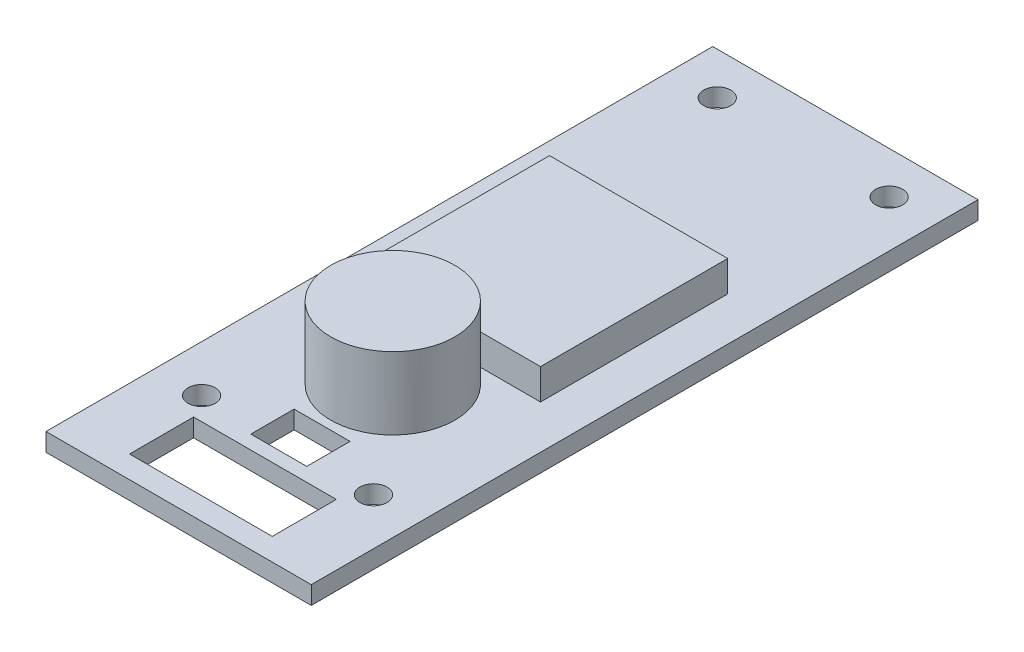
ISO-10303-21;
HEADER;
FILE_DESCRIPTION(('STEP AP214'),'2;1');
FILE_NAME('part.step','',(''),(''),'','','');
FILE_SCHEMA(('AUTOMOTIVE_DESIGN { 1 0 10303 214 1 1 1 1 }'));
ENDSEC;
DATA;
#1=APPLICATION_CONTEXT('core data for automotive mechanical design processes');
#2=APPLICATION_PROTOCOL_DEFINITION('international standard','automotive_design',2000,#1);
#3=PRODUCT_CONTEXT('',#1,'mechanical');
#4=PRODUCT('Part','Part','',(#3));
#5=PRODUCT_RELATED_PRODUCT_CATEGORY('part','',(#4));
#6=PRODUCT_DEFINITION_FORMATION('','',#4);
#7=PRODUCT_DEFINITION_CONTEXT('part definition',#1,'design');
#8=PRODUCT_DEFINITION('design','',#6,#7);
#9=PRODUCT_DEFINITION_SHAPE('','',#8);
#10=(LENGTH_UNIT() NAMED_UNIT(*) SI_UNIT(.MILLI.,.METRE.));
#11=(NAMED_UNIT(*) PLANE_ANGLE_UNIT() SI_UNIT($,.RADIAN.));
#12=(NAMED_UNIT(*) SI_UNIT($,.STERADIAN.) SOLID_ANGLE_UNIT());
#13=UNCERTAINTY_MEASURE_WITH_UNIT(LENGTH_MEASURE(1.E-05),#10,'distance_accuracy_value','');
#14=(GEOMETRIC_REPRESENTATION_CONTEXT(3) GLOBAL_UNCERTAINTY_ASSIGNED_CONTEXT((#13)) GLOBAL_UNIT_ASSIGNED_CONTEXT((#10,
#11,#12)) REPRESENTATION_CONTEXT('',''));
#15=CARTESIAN_POINT('',(0.,0.,0.));
#16=DIRECTION('',(0.,0.,1.));
#17=DIRECTION('',(1.,0.,0.));
#18=AXIS2_PLACEMENT_3D('',#15,#16,#17);
#19=CARTESIAN_POINT('',(0.,2.,36.95));
#20=DIRECTION('',(0.,0.,1.));
#21=DIRECTION('',(1.,0.,0.));
#22=AXIS2_PLACEMENT_3D('',#19,#20,#21);
#23=PLANE('',#22);
#24=DIRECTION('',(-1.,0.,0.));
#25=VECTOR('',#24,1.);
#26=CARTESIAN_POINT('',(0.,0.,36.95));
#27=LINE('',#26,#25);
#28=CARTESIAN_POINT('',(14.7,0.,36.95));
#29=VERTEX_POINT('',#28);
#30=CARTESIAN_POINT('',(-14.7,0.,36.95));
#31=VERTEX_POINT('',#30);
#32=EDGE_CURVE('E280',#29,#31,#27,.T.);
#33=ORIENTED_EDGE('',*,*,#32,.F.);
#34=DIRECTION('',(0.,-1.,0.));
#35=VECTOR('',#34,1.);
#36=CARTESIAN_POINT('',(14.7,2.,36.95));
#37=LINE('',#36,#35);
#38=CARTESIAN_POINT('',(14.7,2.,36.95));
#39=VERTEX_POINT('',#38);
#40=EDGE_CURVE('E12',#39,#29,#37,.T.);
#41=ORIENTED_EDGE('',*,*,#40,.F.);
#42=DIRECTION('',(-1.,0.,0.));
#43=VECTOR('',#42,1.);
#44=CARTESIAN_POINT('',(0.,2.,36.95));
#45=LINE('',#44,#43);
#46=CARTESIAN_POINT('',(-14.7,2.,36.95));
#47=VERTEX_POINT('',#46);
#48=EDGE_CURVE('E190',#39,#47,#45,.T.);
#49=ORIENTED_EDGE('',*,*,#48,.T.);
#50=DIRECTION('',(0.,-1.,0.));
#51=VECTOR('',#50,1.);
#52=CARTESIAN_POINT('',(-14.7,2.,36.95));
#53=LINE('',#52,#51);
#54=EDGE_CURVE('E76',#47,#31,#53,.T.);
#55=ORIENTED_EDGE('',*,*,#54,.T.);
#56=EDGE_LOOP('',(#33,#41,#49,#55));
#57=FACE_BOUND('',#56,.T.);
#58=ADVANCED_FACE('F49',(#57),#23,.T.);
#59=CARTESIAN_POINT('',(14.7,2.,0.));
#60=DIRECTION('',(-1.,0.,0.));
#61=DIRECTION('',(0.,0.,1.));
#62=AXIS2_PLACEMENT_3D('',#59,#60,#61);
#63=PLANE('',#62);
#64=DIRECTION('',(0.,0.,-1.));
#65=VECTOR('',#64,1.);
#66=CARTESIAN_POINT('',(14.7,0.,0.));
#67=LINE('',#66,#65);
#68=CARTESIAN_POINT('',(14.7,0.,-36.95));
#69=VERTEX_POINT('',#68);
#70=EDGE_CURVE('E196',#29,#69,#67,.T.);
#71=ORIENTED_EDGE('',*,*,#70,.T.);
#72=DIRECTION('',(0.,-1.,0.));
#73=VECTOR('',#72,1.);
#74=CARTESIAN_POINT('',(14.7,2.,-36.95));
#75=LINE('',#74,#73);
#76=CARTESIAN_POINT('',(14.7,2.,-36.95));
#77=VERTEX_POINT('',#76);
#78=EDGE_CURVE('E59',#77,#69,#75,.T.);
#79=ORIENTED_EDGE('',*,*,#78,.F.);
#80=DIRECTION('',(0.,0.,-1.));
#81=VECTOR('',#80,1.);
#82=CARTESIAN_POINT('',(14.7,2.,0.));
#83=LINE('',#82,#81);
#84=EDGE_CURVE('E185',#39,#77,#83,.T.);
#85=ORIENTED_EDGE('',*,*,#84,.F.);
#86=ORIENTED_EDGE('',*,*,#40,.T.);
#87=EDGE_LOOP('',(#71,#79,#85,#86));
#88=FACE_BOUND('',#87,.T.);
#89=ADVANCED_FACE('F194',(#88),#63,.F.);
#90=CARTESIAN_POINT('',(0.,2.,-36.95));
#91=DIRECTION('',(0.,0.,1.));
#92=DIRECTION('',(1.,0.,0.));
#93=AXIS2_PLACEMENT_3D('',#90,#91,#92);
#94=PLANE('',#93);
#95=DIRECTION('',(-1.,0.,0.));
#96=VECTOR('',#95,1.);
#97=CARTESIAN_POINT('',(0.,0.,-36.95));
#98=LINE('',#97,#96);
#99=CARTESIAN_POINT('',(-14.7,0.,-36.95));
#100=VERTEX_POINT('',#99);
#101=EDGE_CURVE('E285',#69,#100,#98,.T.);
#102=ORIENTED_EDGE('',*,*,#101,.T.);
#103=DIRECTION('',(0.,-1.,0.));
#104=VECTOR('',#103,1.);
#105=CARTESIAN_POINT('',(-14.7,2.,-36.95));
#106=LINE('',#105,#104);
#107=CARTESIAN_POINT('',(-14.7,2.,-36.95));
#108=VERTEX_POINT('',#107);
#109=EDGE_CURVE('E180',#108,#100,#106,.T.);
#110=ORIENTED_EDGE('',*,*,#109,.F.);
#111=DIRECTION('',(-1.,0.,0.));
#112=VECTOR('',#111,1.);
#113=CARTESIAN_POINT('',(0.,2.,-36.95));
#114=LINE('',#113,#112);
#115=EDGE_CURVE('E174',#77,#108,#114,.T.);
#116=ORIENTED_EDGE('',*,*,#115,.F.);
#117=ORIENTED_EDGE('',*,*,#78,.T.);
#118=EDGE_LOOP('',(#102,#110,#116,#117));
#119=FACE_BOUND('',#118,.T.);
#120=ADVANCED_FACE('F177',(#119),#94,.F.);
#121=CARTESIAN_POINT('',(-7.91000000000001,2.,0.));
#122=DIRECTION('',(1.,0.,0.));
#123=DIRECTION('',(0.,0.,-1.));
#124=AXIS2_PLACEMENT_3D('',#121,#122,#123);
#125=PLANE('',#124);
#126=DIRECTION('',(0.,0.,1.));
#127=VECTOR('',#126,1.);
#128=CARTESIAN_POINT('',(-7.91000000000001,0.,0.));
#129=LINE('',#128,#127);
#130=CARTESIAN_POINT('',(-7.91,0.,27.382));
#131=VERTEX_POINT('',#130);
#132=CARTESIAN_POINT('',(-7.91,0.,34.482));
#133=VERTEX_POINT('',#132);
#134=EDGE_CURVE('E264',#131,#133,#129,.T.);
#135=ORIENTED_EDGE('',*,*,#134,.F.);
#136=DIRECTION('',(0.,-1.,0.));
#137=VECTOR('',#136,1.);
#138=CARTESIAN_POINT('',(-7.91,2.,27.382));
#139=LINE('',#138,#137);
#140=CARTESIAN_POINT('',(-7.91,2.,27.382));
#141=VERTEX_POINT('',#140);
#142=EDGE_CURVE('E213',#141,#131,#139,.T.);
#143=ORIENTED_EDGE('',*,*,#142,.F.);
#144=DIRECTION('',(0.,0.,1.));
#145=VECTOR('',#144,1.);
#146=CARTESIAN_POINT('',(-7.91000000000001,2.,0.));
#147=LINE('',#146,#145);
#148=CARTESIAN_POINT('',(-7.91,2.,34.482));
#149=VERTEX_POINT('',#148);
#150=EDGE_CURVE('E327',#141,#149,#147,.T.);
#151=ORIENTED_EDGE('',*,*,#150,.T.);
#152=DIRECTION('',(0.,-1.,0.));
#153=VECTOR('',#152,1.);
#154=CARTESIAN_POINT('',(-7.91,2.,34.482));
#155=LINE('',#154,#153);
#156=EDGE_CURVE('E203',#149,#133,#155,.T.);
#157=ORIENTED_EDGE('',*,*,#156,.T.);
#158=EDGE_LOOP('',(#135,#143,#151,#157));
#159=FACE_BOUND('',#158,.T.);
#160=ADVANCED_FACE('F480',(#159),#125,.T.);
#161=CARTESIAN_POINT('',(0.,2.,27.382));
#162=DIRECTION('',(0.,0.,-1.));
#163=DIRECTION('',(-1.,0.,0.));
#164=AXIS2_PLACEMENT_3D('',#161,#162,#163);
#165=PLANE('',#164);
#166=DIRECTION('',(1.,0.,0.));
#167=VECTOR('',#166,1.);
#168=CARTESIAN_POINT('',(0.,0.,27.382));
#169=LINE('',#168,#167);
#170=CARTESIAN_POINT('',(7.91,0.,27.382));
#171=VERTEX_POINT('',#170);
#172=EDGE_CURVE('E268',#131,#171,#169,.T.);
#173=ORIENTED_EDGE('',*,*,#172,.T.);
#174=DIRECTION('',(0.,-1.,0.));
#175=VECTOR('',#174,1.);
#176=CARTESIAN_POINT('',(7.91,2.,27.382));
#177=LINE('',#176,#175);
#178=CARTESIAN_POINT('',(7.91,2.,27.382));
#179=VERTEX_POINT('',#178);
#180=EDGE_CURVE('E209',#179,#171,#177,.T.);
#181=ORIENTED_EDGE('',*,*,#180,.F.);
#182=DIRECTION('',(1.,0.,0.));
#183=VECTOR('',#182,1.);
#184=CARTESIAN_POINT('',(0.,2.,27.382));
#185=LINE('',#184,#183);
#186=EDGE_CURVE('E331',#141,#179,#185,.T.);
#187=ORIENTED_EDGE('',*,*,#186,.F.);
#188=ORIENTED_EDGE('',*,*,#142,.T.);
#189=EDGE_LOOP('',(#173,#181,#187,#188));
#190=FACE_BOUND('',#189,.T.);
#191=ADVANCED_FACE('F476',(#190),#165,.F.);
#192=CARTESIAN_POINT('',(7.90999999999999,2.,0.));
#193=DIRECTION('',(1.,0.,0.));
#194=DIRECTION('',(0.,0.,-1.));
#195=AXIS2_PLACEMENT_3D('',#192,#193,#194);
#196=PLANE('',#195);
#197=DIRECTION('',(0.,0.,1.));
#198=VECTOR('',#197,1.);
#199=CARTESIAN_POINT('',(7.90999999999999,0.,0.));
#200=LINE('',#199,#198);
#201=CARTESIAN_POINT('',(7.91,0.,34.482));
#202=VERTEX_POINT('',#201);
#203=EDGE_CURVE('E272',#171,#202,#200,.T.);
#204=ORIENTED_EDGE('',*,*,#203,.T.);
#205=DIRECTION('',(0.,-1.,0.));
#206=VECTOR('',#205,1.);
#207=CARTESIAN_POINT('',(7.91,2.,34.482));
#208=LINE('',#207,#206);
#209=CARTESIAN_POINT('',(7.91,2.,34.482));
#210=VERTEX_POINT('',#209);
#211=EDGE_CURVE('E206',#210,#202,#208,.T.);
#212=ORIENTED_EDGE('',*,*,#211,.F.);
#213=DIRECTION('',(0.,0.,1.));
#214=VECTOR('',#213,1.);
#215=CARTESIAN_POINT('',(7.90999999999999,2.,0.));
#216=LINE('',#215,#214);
#217=EDGE_CURVE('E335',#179,#210,#216,.T.);
#218=ORIENTED_EDGE('',*,*,#217,.F.);
#219=ORIENTED_EDGE('',*,*,#180,.T.);
#220=EDGE_LOOP('',(#204,#212,#218,#219));
#221=FACE_BOUND('',#220,.T.);
#222=ADVANCED_FACE('F473',(#221),#196,.F.);
#223=CARTESIAN_POINT('',(3.1,2.,0.));
#224=DIRECTION('',(-1.,0.,0.));
#225=DIRECTION('',(0.,0.,1.));
#226=AXIS2_PLACEMENT_3D('',#223,#224,#225);
#227=PLANE('',#226);
#228=DIRECTION('',(0.,0.,-1.));
#229=VECTOR('',#228,1.);
#230=CARTESIAN_POINT('',(3.1,0.,0.));
#231=LINE('',#230,#229);
#232=CARTESIAN_POINT('',(3.1,0.,25.849));
#233=VERTEX_POINT('',#232);
#234=CARTESIAN_POINT('',(3.1,0.,21.049));
#235=VERTEX_POINT('',#234);
#236=EDGE_CURVE('E245',#233,#235,#231,.T.);
#237=ORIENTED_EDGE('',*,*,#236,.F.);
#238=DIRECTION('',(0.,-1.,0.));
#239=VECTOR('',#238,1.);
#240=CARTESIAN_POINT('',(3.1,2.,25.849));
#241=LINE('',#240,#239);
#242=CARTESIAN_POINT('',(3.1,2.,25.849));
#243=VERTEX_POINT('',#242);
#244=EDGE_CURVE('E53',#243,#233,#241,.T.);
#245=ORIENTED_EDGE('',*,*,#244,.F.);
#246=DIRECTION('',(0.,0.,-1.));
#247=VECTOR('',#246,1.);
#248=CARTESIAN_POINT('',(3.1,2.,0.));
#249=LINE('',#248,#247);
#250=CARTESIAN_POINT('',(3.1,2.,21.049));
#251=VERTEX_POINT('',#250);
#252=EDGE_CURVE('E315',#243,#251,#249,.T.);
#253=ORIENTED_EDGE('',*,*,#252,.T.);
#254=DIRECTION('',(0.,-1.,0.));
#255=VECTOR('',#254,1.);
#256=CARTESIAN_POINT('',(3.1,2.,21.049));
#257=LINE('',#256,#255);
#258=EDGE_CURVE('E216',#251,#235,#257,.T.);
#259=ORIENTED_EDGE('',*,*,#258,.T.);
#260=EDGE_LOOP('',(#237,#245,#253,#259));
#261=FACE_BOUND('',#260,.T.);
#262=ADVANCED_FACE('F51',(#261),#227,.T.);
#263=CARTESIAN_POINT('',(0.,2.,25.849));
#264=DIRECTION('',(0.,0.,1.));
#265=DIRECTION('',(1.,0.,0.));
#266=AXIS2_PLACEMENT_3D('',#263,#264,#265);
#267=PLANE('',#266);
#268=DIRECTION('',(-1.,0.,0.));
#269=VECTOR('',#268,1.);
#270=CARTESIAN_POINT('',(0.,0.,25.849));
#271=LINE('',#270,#269);
#272=CARTESIAN_POINT('',(-3.1,0.,25.849));
#273=VERTEX_POINT('',#272);
#274=EDGE_CURVE('E233',#233,#273,#271,.T.);
#275=ORIENTED_EDGE('',*,*,#274,.T.);
#276=DIRECTION('',(0.,-1.,0.));
#277=VECTOR('',#276,1.);
#278=CARTESIAN_POINT('',(-3.1,2.,25.849));
#279=LINE('',#278,#277);
#280=CARTESIAN_POINT('',(-3.1,2.,25.849));
#281=VERTEX_POINT('',#280);
#282=EDGE_CURVE('E221',#281,#273,#279,.T.);
#283=ORIENTED_EDGE('',*,*,#282,.F.);
#284=DIRECTION('',(-1.,0.,0.));
#285=VECTOR('',#284,1.);
#286=CARTESIAN_POINT('',(0.,2.,25.849));
#287=LINE('',#286,#285);
#288=EDGE_CURVE('E235',#243,#281,#287,.T.);
#289=ORIENTED_EDGE('',*,*,#288,.F.);
#290=ORIENTED_EDGE('',*,*,#244,.T.);
#291=EDGE_LOOP('',(#275,#283,#289,#290));
#292=FACE_BOUND('',#291,.T.);
#293=ADVANCED_FACE('F232',(#292),#267,.F.);
#294=CARTESIAN_POINT('',(-3.1,2.,0.));
#295=DIRECTION('',(-1.,0.,0.));
#296=DIRECTION('',(0.,0.,1.));
#297=AXIS2_PLACEMENT_3D('',#294,#295,#296);
#298=PLANE('',#297);
#299=DIRECTION('',(0.,0.,-1.));
#300=VECTOR('',#299,1.);
#301=CARTESIAN_POINT('',(-3.1,0.,0.));
#302=LINE('',#301,#300);
#303=CARTESIAN_POINT('',(-3.1,0.,21.049));
#304=VERTEX_POINT('',#303);
#305=EDGE_CURVE('E247',#273,#304,#302,.T.);
#306=ORIENTED_EDGE('',*,*,#305,.T.);
#307=DIRECTION('',(0.,-1.,0.));
#308=VECTOR('',#307,1.);
#309=CARTESIAN_POINT('',(-3.1,2.,21.049));
#310=LINE('',#309,#308);
#311=CARTESIAN_POINT('',(-3.1,2.,21.049));
#312=VERTEX_POINT('',#311);
#313=EDGE_CURVE('E219',#312,#304,#310,.T.);
#314=ORIENTED_EDGE('',*,*,#313,.F.);
#315=DIRECTION('',(0.,0.,-1.));
#316=VECTOR('',#315,1.);
#317=CARTESIAN_POINT('',(-3.1,2.,0.));
#318=LINE('',#317,#316);
#319=EDGE_CURVE('E320',#281,#312,#318,.T.);
#320=ORIENTED_EDGE('',*,*,#319,.F.);
#321=ORIENTED_EDGE('',*,*,#282,.T.);
#322=EDGE_LOOP('',(#306,#314,#320,#321));
#323=FACE_BOUND('',#322,.T.);
#324=ADVANCED_FACE('F471',(#323),#298,.F.);
#325=CARTESIAN_POINT('',(0.,2.,34.482));
#326=DIRECTION('',(0.,0.,-1.));
#327=DIRECTION('',(-1.,0.,0.));
#328=AXIS2_PLACEMENT_3D('',#325,#326,#327);
#329=PLANE('',#328);
#330=DIRECTION('',(1.,0.,0.));
#331=VECTOR('',#330,1.);
#332=CARTESIAN_POINT('',(0.,0.,34.482));
#333=LINE('',#332,#331);
#334=EDGE_CURVE('E276',#133,#202,#333,.T.);
#335=ORIENTED_EDGE('',*,*,#334,.F.);
#336=ORIENTED_EDGE('',*,*,#156,.F.);
#337=DIRECTION('',(1.,0.,0.));
#338=VECTOR('',#337,1.);
#339=CARTESIAN_POINT('',(0.,2.,34.482));
#340=LINE('',#339,#338);
#341=EDGE_CURVE('E338',#149,#210,#340,.T.);
#342=ORIENTED_EDGE('',*,*,#341,.T.);
#343=ORIENTED_EDGE('',*,*,#211,.T.);
#344=EDGE_LOOP('',(#335,#336,#342,#343));
#345=FACE_BOUND('',#344,.T.);
#346=ADVANCED_FACE('F467',(#345),#329,.T.);
#347=CARTESIAN_POINT('',(0.,2.,21.049));
#348=DIRECTION('',(0.,0.,1.));
#349=DIRECTION('',(1.,0.,0.));
#350=AXIS2_PLACEMENT_3D('',#347,#348,#349);
#351=PLANE('',#350);
#352=DIRECTION('',(-1.,0.,0.));
#353=VECTOR('',#352,1.);
#354=CARTESIAN_POINT('',(0.,0.,21.049));
#355=LINE('',#354,#353);
#356=EDGE_CURVE('E261',#235,#304,#355,.T.);
#357=ORIENTED_EDGE('',*,*,#356,.F.);
#358=ORIENTED_EDGE('',*,*,#258,.F.);
#359=DIRECTION('',(-1.,0.,0.));
#360=VECTOR('',#359,1.);
#361=CARTESIAN_POINT('',(0.,2.,21.049));
#362=LINE('',#361,#360);
#363=EDGE_CURVE('E323',#251,#312,#362,.T.);
#364=ORIENTED_EDGE('',*,*,#363,.T.);
#365=ORIENTED_EDGE('',*,*,#313,.T.);
#366=EDGE_LOOP('',(#357,#358,#364,#365));
#367=FACE_BOUND('',#366,.T.);
#368=ADVANCED_FACE('F470',(#367),#351,.T.);
#369=CARTESIAN_POINT('',(-14.7,2.,0.));
#370=DIRECTION('',(-1.,0.,0.));
#371=DIRECTION('',(0.,0.,1.));
#372=AXIS2_PLACEMENT_3D('',#369,#370,#371);
#373=PLANE('',#372);
#374=DIRECTION('',(0.,0.,-1.));
#375=VECTOR('',#374,1.);
#376=CARTESIAN_POINT('',(-14.7,0.,0.));
#377=LINE('',#376,#375);
#378=EDGE_CURVE('E288',#31,#100,#377,.T.);
#379=ORIENTED_EDGE('',*,*,#378,.F.);
#380=ORIENTED_EDGE('',*,*,#54,.F.);
#381=DIRECTION('',(0.,0.,-1.));
#382=VECTOR('',#381,1.);
#383=CARTESIAN_POINT('',(-14.7,2.,0.));
#384=LINE('',#383,#382);
#385=EDGE_CURVE('E184',#47,#108,#384,.T.);
#386=ORIENTED_EDGE('',*,*,#385,.T.);
#387=ORIENTED_EDGE('',*,*,#109,.T.);
#388=EDGE_LOOP('',(#379,#380,#386,#387));
#389=FACE_BOUND('',#388,.T.);
#390=ADVANCED_FACE('F344',(#389),#373,.T.);
#391=CARTESIAN_POINT('',(0.,2.,0.));
#392=DIRECTION('',(0.,1.,0.));
#393=DIRECTION('',(0.,0.,1.));
#394=AXIS2_PLACEMENT_3D('',#391,#392,#393);
#395=PLANE('',#394);
#396=CARTESIAN_POINT('',(-9.525,2.,24.875));
#397=DIRECTION('',(0.,1.,0.));
#398=DIRECTION('',(0.,0.,1.));
#399=AXIS2_PLACEMENT_3D('',#396,#397,#398);
#400=CIRCLE('',#399,1.5);
#401=CARTESIAN_POINT('',(-9.525,2.,26.375));
#402=VERTEX_POINT('',#401);
#403=EDGE_CURVE('E892',#402,#402,#400,.T.);
#404=ORIENTED_EDGE('',*,*,#403,.F.);
#405=EDGE_LOOP('',(#404));
#406=FACE_BOUND('',#405,.T.);
#407=CARTESIAN_POINT('',(9.52500000000001,2.,24.875));
#408=DIRECTION('',(0.,1.,0.));
#409=DIRECTION('',(0.,0.,1.));
#410=AXIS2_PLACEMENT_3D('',#407,#408,#409);
#411=CIRCLE('',#410,1.5);
#412=CARTESIAN_POINT('',(9.52500000000001,2.,26.375));
#413=VERTEX_POINT('',#412);
#414=EDGE_CURVE('E917',#413,#413,#411,.T.);
#415=ORIENTED_EDGE('',*,*,#414,.F.);
#416=EDGE_LOOP('',(#415));
#417=FACE_BOUND('',#416,.T.);
#418=CARTESIAN_POINT('',(9.525,2.,-32.275));
#419=DIRECTION('',(0.,1.,0.));
#420=DIRECTION('',(0.,0.,1.));
#421=AXIS2_PLACEMENT_3D('',#418,#419,#420);
#422=CIRCLE('',#421,1.5);
#423=CARTESIAN_POINT('',(9.525,2.,-30.775));
#424=VERTEX_POINT('',#423);
#425=EDGE_CURVE('E913',#424,#424,#422,.T.);
#426=ORIENTED_EDGE('',*,*,#425,.F.);
#427=EDGE_LOOP('',(#426));
#428=FACE_BOUND('',#427,.T.);
#429=CARTESIAN_POINT('',(-9.525,2.,-32.275));
#430=DIRECTION('',(0.,1.,0.));
#431=DIRECTION('',(0.,0.,1.));
#432=AXIS2_PLACEMENT_3D('',#429,#430,#431);
#433=CIRCLE('',#432,1.5);
#434=CARTESIAN_POINT('',(-9.525,2.,-30.775));
#435=VERTEX_POINT('',#434);
#436=EDGE_CURVE('E909',#435,#435,#433,.T.);
#437=ORIENTED_EDGE('',*,*,#436,.F.);
#438=EDGE_LOOP('',(#437));
#439=FACE_BOUND('',#438,.T.);
#440=CARTESIAN_POINT('',(0.,2.,13.214));
#441=DIRECTION('',(0.,1.,0.));
#442=DIRECTION('',(0.,0.,1.));
#443=AXIS2_PLACEMENT_3D('',#440,#441,#442);
#444=CIRCLE('',#443,6.875);
#445=CARTESIAN_POINT('',(-2.2395591083961,2.,6.71400000000001));
#446=VERTEX_POINT('',#445);
#447=CARTESIAN_POINT('',(2.23955910839613,2.,6.71400000000001));
#448=VERTEX_POINT('',#447);
#449=EDGE_CURVE('E127',#446,#448,#444,.T.);
#450=ORIENTED_EDGE('',*,*,#449,.F.);
#451=DIRECTION('',(-1.,0.,0.));
#452=VECTOR('',#451,1.);
#453=CARTESIAN_POINT('',(0.,2.,6.71400000000001));
#454=LINE('',#453,#452);
#455=CARTESIAN_POINT('',(-9.87499999999999,2.,6.71400000000002));
#456=VERTEX_POINT('',#455);
#457=EDGE_CURVE('E294',#446,#456,#454,.T.);
#458=ORIENTED_EDGE('',*,*,#457,.T.);
#459=DIRECTION('',(0.,0.,1.));
#460=VECTOR('',#459,1.);
#461=CARTESIAN_POINT('',(-9.87499999999999,2.,0.));
#462=LINE('',#461,#460);
#463=CARTESIAN_POINT('',(-9.87499999999999,2.,-14.036));
#464=VERTEX_POINT('',#463);
#465=EDGE_CURVE('E300',#464,#456,#462,.T.);
#466=ORIENTED_EDGE('',*,*,#465,.F.);
#467=DIRECTION('',(-1.,0.,0.));
#468=VECTOR('',#467,1.);
#469=CARTESIAN_POINT('',(0.,2.,-14.036));
#470=LINE('',#469,#468);
#471=CARTESIAN_POINT('',(9.87500000000001,2.,-14.036));
#472=VERTEX_POINT('',#471);
#473=EDGE_CURVE('E308',#472,#464,#470,.T.);
#474=ORIENTED_EDGE('',*,*,#473,.F.);
#475=DIRECTION('',(0.,0.,1.));
#476=VECTOR('',#475,1.);
#477=CARTESIAN_POINT('',(9.87500000000002,2.,0.));
#478=LINE('',#477,#476);
#479=CARTESIAN_POINT('',(9.87500000000002,2.,6.71400000000001));
#480=VERTEX_POINT('',#479);
#481=EDGE_CURVE('E312',#472,#480,#478,.T.);
#482=ORIENTED_EDGE('',*,*,#481,.T.);
#483=EDGE_CURVE('E302',#480,#448,#454,.T.);
#484=ORIENTED_EDGE('',*,*,#483,.T.);
#485=EDGE_LOOP('',(#450,#458,#466,#474,#482,#484));
#486=FACE_BOUND('',#485,.T.);
#487=ORIENTED_EDGE('',*,*,#252,.F.);
#488=ORIENTED_EDGE('',*,*,#288,.T.);
#489=ORIENTED_EDGE('',*,*,#319,.T.);
#490=ORIENTED_EDGE('',*,*,#363,.F.);
#491=EDGE_LOOP('',(#487,#488,#489,#490));
#492=FACE_BOUND('',#491,.T.);
#493=ORIENTED_EDGE('',*,*,#150,.F.);
#494=ORIENTED_EDGE('',*,*,#186,.T.);
#495=ORIENTED_EDGE('',*,*,#217,.T.);
#496=ORIENTED_EDGE('',*,*,#341,.F.);
#497=EDGE_LOOP('',(#493,#494,#495,#496));
#498=FACE_BOUND('',#497,.T.);
#499=ORIENTED_EDGE('',*,*,#48,.F.);
#500=ORIENTED_EDGE('',*,*,#84,.T.);
#501=ORIENTED_EDGE('',*,*,#115,.T.);
#502=ORIENTED_EDGE('',*,*,#385,.F.);
#503=EDGE_LOOP('',(#499,#500,#501,#502));
#504=FACE_BOUND('',#503,.T.);
#505=ADVANCED_FACE('F189',(#406,#417,#428,#439,#486,#492,#498,#504),#395,.T.);
#506=CARTESIAN_POINT('',(0.,0.,0.));
#507=DIRECTION('',(0.,1.,0.));
#508=DIRECTION('',(0.,0.,1.));
#509=AXIS2_PLACEMENT_3D('',#506,#507,#508);
#510=PLANE('',#509);
#511=CARTESIAN_POINT('',(-9.525,0.,24.875));
#512=DIRECTION('',(0.,1.,0.));
#513=DIRECTION('',(0.,0.,1.));
#514=AXIS2_PLACEMENT_3D('',#511,#512,#513);
#515=CIRCLE('',#514,1.5);
#516=CARTESIAN_POINT('',(-9.525,0.,26.375));
#517=VERTEX_POINT('',#516);
#518=EDGE_CURVE('E895',#517,#517,#515,.T.);
#519=ORIENTED_EDGE('',*,*,#518,.T.);
#520=EDGE_LOOP('',(#519));
#521=FACE_BOUND('',#520,.T.);
#522=CARTESIAN_POINT('',(9.52500000000001,0.,24.875));
#523=DIRECTION('',(0.,1.,0.));
#524=DIRECTION('',(0.,0.,1.));
#525=AXIS2_PLACEMENT_3D('',#522,#523,#524);
#526=CIRCLE('',#525,1.5);
#527=CARTESIAN_POINT('',(9.52500000000001,0.,26.375));
#528=VERTEX_POINT('',#527);
#529=EDGE_CURVE('E897',#528,#528,#526,.T.);
#530=ORIENTED_EDGE('',*,*,#529,.T.);
#531=EDGE_LOOP('',(#530));
#532=FACE_BOUND('',#531,.T.);
#533=CARTESIAN_POINT('',(9.525,0.,-32.275));
#534=DIRECTION('',(0.,1.,0.));
#535=DIRECTION('',(0.,0.,1.));
#536=AXIS2_PLACEMENT_3D('',#533,#534,#535);
#537=CIRCLE('',#536,1.5);
#538=CARTESIAN_POINT('',(9.525,0.,-30.775));
#539=VERTEX_POINT('',#538);
#540=EDGE_CURVE('E901',#539,#539,#537,.T.);
#541=ORIENTED_EDGE('',*,*,#540,.T.);
#542=EDGE_LOOP('',(#541));
#543=FACE_BOUND('',#542,.T.);
#544=CARTESIAN_POINT('',(-9.525,0.,-32.275));
#545=DIRECTION('',(0.,1.,0.));
#546=DIRECTION('',(0.,0.,1.));
#547=AXIS2_PLACEMENT_3D('',#544,#545,#546);
#548=CIRCLE('',#547,1.5);
#549=CARTESIAN_POINT('',(-9.525,0.,-30.775));
#550=VERTEX_POINT('',#549);
#551=EDGE_CURVE('E905',#550,#550,#548,.T.);
#552=ORIENTED_EDGE('',*,*,#551,.T.);
#553=EDGE_LOOP('',(#552));
#554=FACE_BOUND('',#553,.T.);
#555=DIRECTION('',(0.,0.,1.));
#556=VECTOR('',#555,1.);
#557=CARTESIAN_POINT('',(9.50000000000001,0.,-13.161));
#558=LINE('',#557,#556);
#559=CARTESIAN_POINT('',(9.50000000000001,0.,-13.161));
#560=VERTEX_POINT('',#559);
#561=CARTESIAN_POINT('',(9.50000000000001,0.,5.83900000000001));
#562=VERTEX_POINT('',#561);
#563=EDGE_CURVE('E927',#560,#562,#558,.T.);
#564=ORIENTED_EDGE('',*,*,#563,.F.);
#565=DIRECTION('',(1.,0.,0.));
#566=VECTOR('',#565,1.);
#567=CARTESIAN_POINT('',(9.50000000000001,0.,-13.161));
#568=LINE('',#567,#566);
#569=CARTESIAN_POINT('',(-9.49999999999999,0.,-13.161));
#570=VERTEX_POINT('',#569);
#571=EDGE_CURVE('E931',#570,#560,#568,.T.);
#572=ORIENTED_EDGE('',*,*,#571,.F.);
#573=DIRECTION('',(0.,0.,-1.));
#574=VECTOR('',#573,1.);
#575=CARTESIAN_POINT('',(-9.49999999999999,0.,-13.161));
#576=LINE('',#575,#574);
#577=CARTESIAN_POINT('',(-9.49999999999999,0.,5.83900000000001));
#578=VERTEX_POINT('',#577);
#579=EDGE_CURVE('E923',#578,#570,#576,.T.);
#580=ORIENTED_EDGE('',*,*,#579,.F.);
#581=DIRECTION('',(-1.,0.,0.));
#582=VECTOR('',#581,1.);
#583=CARTESIAN_POINT('',(9.50000000000001,0.,5.83900000000001));
#584=LINE('',#583,#582);
#585=EDGE_CURVE('E67',#562,#578,#584,.T.);
#586=ORIENTED_EDGE('',*,*,#585,.F.);
#587=EDGE_LOOP('',(#564,#572,#580,#586));
#588=FACE_BOUND('',#587,.T.);
#589=ORIENTED_EDGE('',*,*,#236,.T.);
#590=ORIENTED_EDGE('',*,*,#356,.T.);
#591=ORIENTED_EDGE('',*,*,#305,.F.);
#592=ORIENTED_EDGE('',*,*,#274,.F.);
#593=EDGE_LOOP('',(#589,#590,#591,#592));
#594=FACE_BOUND('',#593,.T.);
#595=ORIENTED_EDGE('',*,*,#134,.T.);
#596=ORIENTED_EDGE('',*,*,#334,.T.);
#597=ORIENTED_EDGE('',*,*,#203,.F.);
#598=ORIENTED_EDGE('',*,*,#172,.F.);
#599=EDGE_LOOP('',(#595,#596,#597,#598));
#600=FACE_BOUND('',#599,.T.);
#601=ORIENTED_EDGE('',*,*,#32,.T.);
#602=ORIENTED_EDGE('',*,*,#378,.T.);
#603=ORIENTED_EDGE('',*,*,#101,.F.);
#604=ORIENTED_EDGE('',*,*,#70,.F.);
#605=EDGE_LOOP('',(#601,#602,#603,#604));
#606=FACE_BOUND('',#605,.T.);
#607=CARTESIAN_POINT('',(0.,0.,13.214));
#608=DIRECTION('',(0.,1.,0.));
#609=DIRECTION('',(0.,0.,1.));
#610=AXIS2_PLACEMENT_3D('',#607,#608,#609);
#611=CIRCLE('',#610,6.125);
#612=CARTESIAN_POINT('',(0.,0.,19.339));
#613=VERTEX_POINT('',#612);
#614=EDGE_CURVE('E352',#613,#613,#611,.T.);
#615=ORIENTED_EDGE('',*,*,#614,.T.);
#616=EDGE_LOOP('',(#615));
#617=FACE_BOUND('',#616,.T.);
#618=ADVANCED_FACE('F242',(#521,#532,#543,#554,#588,#594,#600,#606,#617),#510,.F.);
#619=CARTESIAN_POINT('',(0.,5.4,6.71400000000001));
#620=DIRECTION('',(0.,0.,1.));
#621=DIRECTION('',(1.,0.,0.));
#622=AXIS2_PLACEMENT_3D('',#619,#620,#621);
#623=PLANE('',#622);
#624=DIRECTION('',(0.,-1.,0.));
#625=VECTOR('',#624,1.);
#626=CARTESIAN_POINT('',(2.23955910839613,5.4,6.71400000000001));
#627=LINE('',#626,#625);
#628=CARTESIAN_POINT('',(2.23955910839613,5.4,6.71400000000001));
#629=VERTEX_POINT('',#628);
#630=EDGE_CURVE('E251',#629,#448,#627,.T.);
#631=ORIENTED_EDGE('',*,*,#630,.T.);
#632=ORIENTED_EDGE('',*,*,#483,.F.);
#633=DIRECTION('',(0.,-1.,0.));
#634=VECTOR('',#633,1.);
#635=CARTESIAN_POINT('',(9.87500000000002,5.4,6.71400000000001));
#636=LINE('',#635,#634);
#637=CARTESIAN_POINT('',(9.87500000000002,5.4,6.71400000000001));
#638=VERTEX_POINT('',#637);
#639=EDGE_CURVE('E255',#638,#480,#636,.T.);
#640=ORIENTED_EDGE('',*,*,#639,.F.);
#641=DIRECTION('',(-1.,0.,0.));
#642=VECTOR('',#641,1.);
#643=CARTESIAN_POINT('',(0.,5.4,6.71400000000001));
#644=LINE('',#643,#642);
#645=EDGE_CURVE('E374',#638,#629,#644,.T.);
#646=ORIENTED_EDGE('',*,*,#645,.T.);
#647=EDGE_LOOP('',(#631,#632,#640,#646));
#648=FACE_BOUND('',#647,.T.);
#649=ADVANCED_FACE('F347',(#648),#623,.T.);
#650=CARTESIAN_POINT('',(9.87500000000002,5.4,0.));
#651=DIRECTION('',(1.,0.,0.));
#652=DIRECTION('',(0.,0.,-1.));
#653=AXIS2_PLACEMENT_3D('',#650,#651,#652);
#654=PLANE('',#653);
#655=ORIENTED_EDGE('',*,*,#639,.T.);
#656=ORIENTED_EDGE('',*,*,#481,.F.);
#657=DIRECTION('',(0.,-1.,0.));
#658=VECTOR('',#657,1.);
#659=CARTESIAN_POINT('',(9.87500000000001,5.4,-14.036));
#660=LINE('',#659,#658);
#661=CARTESIAN_POINT('',(9.87500000000001,5.4,-14.036));
#662=VERTEX_POINT('',#661);
#663=EDGE_CURVE('E402',#662,#472,#660,.T.);
#664=ORIENTED_EDGE('',*,*,#663,.F.);
#665=DIRECTION('',(0.,0.,1.));
#666=VECTOR('',#665,1.);
#667=CARTESIAN_POINT('',(9.87500000000002,5.4,0.));
#668=LINE('',#667,#666);
#669=EDGE_CURVE('E378',#662,#638,#668,.T.);
#670=ORIENTED_EDGE('',*,*,#669,.T.);
#671=EDGE_LOOP('',(#655,#656,#664,#670));
#672=FACE_BOUND('',#671,.T.);
#673=ADVANCED_FACE('F410',(#672),#654,.T.);
#674=CARTESIAN_POINT('',(0.,5.4,-14.036));
#675=DIRECTION('',(0.,0.,1.));
#676=DIRECTION('',(1.,0.,0.));
#677=AXIS2_PLACEMENT_3D('',#674,#675,#676);
#678=PLANE('',#677);
#679=ORIENTED_EDGE('',*,*,#473,.T.);
#680=DIRECTION('',(0.,-1.,0.));
#681=VECTOR('',#680,1.);
#682=CARTESIAN_POINT('',(-9.87499999999999,5.4,-14.036));
#683=LINE('',#682,#681);
#684=CARTESIAN_POINT('',(-9.87499999999999,5.4,-14.036));
#685=VERTEX_POINT('',#684);
#686=EDGE_CURVE('E398',#685,#464,#683,.T.);
#687=ORIENTED_EDGE('',*,*,#686,.F.);
#688=DIRECTION('',(-1.,0.,0.));
#689=VECTOR('',#688,1.);
#690=CARTESIAN_POINT('',(0.,5.4,-14.036));
#691=LINE('',#690,#689);
#692=EDGE_CURVE('E383',#662,#685,#691,.T.);
#693=ORIENTED_EDGE('',*,*,#692,.F.);
#694=ORIENTED_EDGE('',*,*,#663,.T.);
#695=EDGE_LOOP('',(#679,#687,#693,#694));
#696=FACE_BOUND('',#695,.T.);
#697=ADVANCED_FACE('F450',(#696),#678,.F.);
#698=CARTESIAN_POINT('',(-9.87499999999999,5.4,0.));
#699=DIRECTION('',(1.,0.,0.));
#700=DIRECTION('',(0.,0.,-1.));
#701=AXIS2_PLACEMENT_3D('',#698,#699,#700);
#702=PLANE('',#701);
#703=ORIENTED_EDGE('',*,*,#465,.T.);
#704=DIRECTION('',(0.,-1.,0.));
#705=VECTOR('',#704,1.);
#706=CARTESIAN_POINT('',(-9.87499999999999,5.4,6.71400000000002));
#707=LINE('',#706,#705);
#708=CARTESIAN_POINT('',(-9.87499999999999,5.4,6.71400000000002));
#709=VERTEX_POINT('',#708);
#710=EDGE_CURVE('E394',#709,#456,#707,.T.);
#711=ORIENTED_EDGE('',*,*,#710,.F.);
#712=DIRECTION('',(0.,0.,1.));
#713=VECTOR('',#712,1.);
#714=CARTESIAN_POINT('',(-9.87499999999999,5.4,0.));
#715=LINE('',#714,#713);
#716=EDGE_CURVE('E387',#685,#709,#715,.T.);
#717=ORIENTED_EDGE('',*,*,#716,.F.);
#718=ORIENTED_EDGE('',*,*,#686,.T.);
#719=EDGE_LOOP('',(#703,#711,#717,#718));
#720=FACE_BOUND('',#719,.T.);
#721=ADVANCED_FACE('F444',(#720),#702,.F.);
#722=ORIENTED_EDGE('',*,*,#710,.T.);
#723=ORIENTED_EDGE('',*,*,#457,.F.);
#724=DIRECTION('',(0.,-1.,0.));
#725=VECTOR('',#724,1.);
#726=CARTESIAN_POINT('',(-2.2395591083961,5.4,6.71400000000001));
#727=LINE('',#726,#725);
#728=CARTESIAN_POINT('',(-2.2395591083961,5.4,6.71400000000001));
#729=VERTEX_POINT('',#728);
#730=EDGE_CURVE('E391',#729,#446,#727,.T.);
#731=ORIENTED_EDGE('',*,*,#730,.F.);
#732=EDGE_CURVE('E379',#729,#709,#644,.T.);
#733=ORIENTED_EDGE('',*,*,#732,.T.);
#734=EDGE_LOOP('',(#722,#723,#731,#733));
#735=FACE_BOUND('',#734,.T.);
#736=ADVANCED_FACE('F446',(#735),#623,.T.);
#737=CARTESIAN_POINT('',(0.,5.4,0.));
#738=DIRECTION('',(0.,1.,0.));
#739=DIRECTION('',(0.,0.,1.));
#740=AXIS2_PLACEMENT_3D('',#737,#738,#739);
#741=PLANE('',#740);
#742=CARTESIAN_POINT('',(0.,5.4,13.214));
#743=DIRECTION('',(0.,1.,0.));
#744=DIRECTION('',(0.,0.,1.));
#745=AXIS2_PLACEMENT_3D('',#742,#743,#744);
#746=CIRCLE('',#745,6.875);
#747=EDGE_CURVE('E370',#629,#729,#746,.T.);
#748=ORIENTED_EDGE('',*,*,#747,.F.);
#749=ORIENTED_EDGE('',*,*,#645,.F.);
#750=ORIENTED_EDGE('',*,*,#669,.F.);
#751=ORIENTED_EDGE('',*,*,#692,.T.);
#752=ORIENTED_EDGE('',*,*,#716,.T.);
#753=ORIENTED_EDGE('',*,*,#732,.F.);
#754=EDGE_LOOP('',(#748,#749,#750,#751,#752,#753));
#755=FACE_BOUND('',#754,.T.);
#756=ADVANCED_FACE('F422',(#755),#741,.T.);
#757=CARTESIAN_POINT('',(0.,10.,13.214));
#758=DIRECTION('',(0.,1.,0.));
#759=DIRECTION('',(0.,0.,1.));
#760=AXIS2_PLACEMENT_3D('',#757,#758,#759);
#761=PLANE('',#760);
#762=CARTESIAN_POINT('',(0.,10.,13.214));
#763=DIRECTION('',(0.,1.,0.));
#764=DIRECTION('',(0.,0.,1.));
#765=AXIS2_PLACEMENT_3D('',#762,#763,#764);
#766=CIRCLE('',#765,6.875);
#767=CARTESIAN_POINT('',(0.,10.,20.089));
#768=VERTEX_POINT('',#767);
#769=EDGE_CURVE('E361',#768,#768,#766,.T.);
#770=ORIENTED_EDGE('',*,*,#769,.T.);
#771=EDGE_LOOP('',(#770));
#772=FACE_BOUND('',#771,.T.);
#773=ADVANCED_FACE('F640',(#772),#761,.T.);
#774=CARTESIAN_POINT('',(0.,10.,13.214));
#775=DIRECTION('',(0.,-1.,0.));
#776=DIRECTION('',(0.,0.,-1.));
#777=AXIS2_PLACEMENT_3D('',#774,#775,#776);
#778=CYLINDRICAL_SURFACE('',#777,6.875);
#779=ORIENTED_EDGE('',*,*,#449,.T.);
#780=ORIENTED_EDGE('',*,*,#630,.F.);
#781=ORIENTED_EDGE('',*,*,#747,.T.);
#782=ORIENTED_EDGE('',*,*,#730,.T.);
#783=EDGE_LOOP('',(#779,#780,#781,#782));
#784=FACE_BOUND('',#783,.T.);
#785=ORIENTED_EDGE('',*,*,#769,.F.);
#786=EDGE_LOOP('',(#785));
#787=FACE_BOUND('',#786,.T.);
#788=ADVANCED_FACE('F428',(#784,#787),#778,.T.);
#789=CARTESIAN_POINT('',(0.,10.,13.214));
#790=DIRECTION('',(0.,-1.,0.));
#791=DIRECTION('',(0.,0.,-1.));
#792=AXIS2_PLACEMENT_3D('',#789,#790,#791);
#793=CYLINDRICAL_SURFACE('',#792,6.125);
#794=CARTESIAN_POINT('',(0.,9.25,13.214));
#795=DIRECTION('',(0.,1.,0.));
#796=DIRECTION('',(0.,0.,1.));
#797=AXIS2_PLACEMENT_3D('',#794,#795,#796);
#798=CIRCLE('',#797,6.125);
#799=CARTESIAN_POINT('',(0.,9.25,19.339));
#800=VERTEX_POINT('',#799);
#801=EDGE_CURVE('E355',#800,#800,#798,.T.);
#802=ORIENTED_EDGE('',*,*,#801,.T.);
#803=EDGE_LOOP('',(#802));
#804=FACE_BOUND('',#803,.T.);
#805=ORIENTED_EDGE('',*,*,#614,.F.);
#806=EDGE_LOOP('',(#805));
#807=FACE_BOUND('',#806,.T.);
#808=ADVANCED_FACE('F639',(#804,#807),#793,.F.);
#809=CARTESIAN_POINT('',(0.,9.25,13.214));
#810=DIRECTION('',(0.,1.,0.));
#811=DIRECTION('',(0.,0.,1.));
#812=AXIS2_PLACEMENT_3D('',#809,#810,#811);
#813=PLANE('',#812);
#814=ORIENTED_EDGE('',*,*,#801,.F.);
#815=EDGE_LOOP('',(#814));
#816=FACE_BOUND('',#815,.T.);
#817=ADVANCED_FACE('F657',(#816),#813,.F.);
#818=CARTESIAN_POINT('',(0.,4.4,0.));
#819=DIRECTION('',(0.,1.,0.));
#820=DIRECTION('',(0.,0.,1.));
#821=AXIS2_PLACEMENT_3D('',#818,#819,#820);
#822=PLANE('',#821);
#823=DIRECTION('',(0.,0.,-1.));
#824=VECTOR('',#823,1.);
#825=CARTESIAN_POINT('',(-9.49999999999999,4.4,-13.161));
#826=LINE('',#825,#824);
#827=CARTESIAN_POINT('',(-9.49999999999998,4.4,5.83900000000001));
#828=VERTEX_POINT('',#827);
#829=CARTESIAN_POINT('',(-9.49999999999998,4.4,-13.161));
#830=VERTEX_POINT('',#829);
#831=EDGE_CURVE('E364',#828,#830,#826,.T.);
#832=ORIENTED_EDGE('',*,*,#831,.T.);
#833=DIRECTION('',(1.,0.,0.));
#834=VECTOR('',#833,1.);
#835=CARTESIAN_POINT('',(9.50000000000001,4.4,-13.161));
#836=LINE('',#835,#834);
#837=CARTESIAN_POINT('',(9.50000000000001,4.4,-13.161));
#838=VERTEX_POINT('',#837);
#839=EDGE_CURVE('E926',#830,#838,#836,.T.);
#840=ORIENTED_EDGE('',*,*,#839,.T.);
#841=DIRECTION('',(0.,0.,1.));
#842=VECTOR('',#841,1.);
#843=CARTESIAN_POINT('',(9.50000000000001,4.4,-13.161));
#844=LINE('',#843,#842);
#845=CARTESIAN_POINT('',(9.50000000000001,4.4,5.83900000000001));
#846=VERTEX_POINT('',#845);
#847=EDGE_CURVE('E951',#838,#846,#844,.T.);
#848=ORIENTED_EDGE('',*,*,#847,.T.);
#849=DIRECTION('',(-1.,0.,0.));
#850=VECTOR('',#849,1.);
#851=CARTESIAN_POINT('',(9.50000000000001,4.4,5.83900000000001));
#852=LINE('',#851,#850);
#853=EDGE_CURVE('E946',#846,#828,#852,.T.);
#854=ORIENTED_EDGE('',*,*,#853,.T.);
#855=EDGE_LOOP('',(#832,#840,#848,#854));
#856=FACE_BOUND('',#855,.T.);
#857=ADVANCED_FACE('F666',(#856),#822,.F.);
#858=CARTESIAN_POINT('',(9.50000000000001,32.2700576850888,-13.161));
#859=DIRECTION('',(0.,0.,-1.));
#860=DIRECTION('',(-1.,0.,0.));
#861=AXIS2_PLACEMENT_3D('',#858,#859,#860);
#862=PLANE('',#861);
#863=DIRECTION('',(0.,-1.,0.));
#864=VECTOR('',#863,1.);
#865=CARTESIAN_POINT('',(-9.49999999999999,32.2700576850888,-13.161));
#866=LINE('',#865,#864);
#867=EDGE_CURVE('E356',#830,#570,#866,.T.);
#868=ORIENTED_EDGE('',*,*,#867,.T.);
#869=ORIENTED_EDGE('',*,*,#571,.T.);
#870=DIRECTION('',(0.,-1.,0.));
#871=VECTOR('',#870,1.);
#872=CARTESIAN_POINT('',(9.50000000000001,32.2700576850888,-13.161));
#873=LINE('',#872,#871);
#874=EDGE_CURVE('E941',#838,#560,#873,.T.);
#875=ORIENTED_EDGE('',*,*,#874,.F.);
#876=ORIENTED_EDGE('',*,*,#839,.F.);
#877=EDGE_LOOP('',(#868,#869,#875,#876));
#878=FACE_BOUND('',#877,.T.);
#879=ADVANCED_FACE('F719',(#878),#862,.F.);
#880=CARTESIAN_POINT('',(9.50000000000001,32.2700576850888,-13.161));
#881=DIRECTION('',(1.,0.,0.));
#882=DIRECTION('',(0.,0.,-1.));
#883=AXIS2_PLACEMENT_3D('',#880,#881,#882);
#884=PLANE('',#883);
#885=ORIENTED_EDGE('',*,*,#874,.T.);
#886=ORIENTED_EDGE('',*,*,#563,.T.);
#887=DIRECTION('',(0.,-1.,0.));
#888=VECTOR('',#887,1.);
#889=CARTESIAN_POINT('',(9.50000000000001,32.2700576850888,5.83900000000001));
#890=LINE('',#889,#888);
#891=EDGE_CURVE('E950',#846,#562,#890,.T.);
#892=ORIENTED_EDGE('',*,*,#891,.F.);
#893=ORIENTED_EDGE('',*,*,#847,.F.);
#894=EDGE_LOOP('',(#885,#886,#892,#893));
#895=FACE_BOUND('',#894,.T.);
#896=ADVANCED_FACE('F728',(#895),#884,.F.);
#897=CARTESIAN_POINT('',(9.50000000000001,32.2700576850888,5.83900000000001));
#898=DIRECTION('',(0.,0.,1.));
#899=DIRECTION('',(1.,0.,0.));
#900=AXIS2_PLACEMENT_3D('',#897,#898,#899);
#901=PLANE('',#900);
#902=ORIENTED_EDGE('',*,*,#891,.T.);
#903=ORIENTED_EDGE('',*,*,#585,.T.);
#904=DIRECTION('',(0.,-1.,0.));
#905=VECTOR('',#904,1.);
#906=CARTESIAN_POINT('',(-9.49999999999999,32.2700576850888,5.83900000000001));
#907=LINE('',#906,#905);
#908=EDGE_CURVE('E945',#828,#578,#907,.T.);
#909=ORIENTED_EDGE('',*,*,#908,.F.);
#910=ORIENTED_EDGE('',*,*,#853,.F.);
#911=EDGE_LOOP('',(#902,#903,#909,#910));
#912=FACE_BOUND('',#911,.T.);
#913=ADVANCED_FACE('F738',(#912),#901,.F.);
#914=CARTESIAN_POINT('',(-9.49999999999999,32.2700576850888,-13.161));
#915=DIRECTION('',(-1.,0.,0.));
#916=DIRECTION('',(0.,0.,1.));
#917=AXIS2_PLACEMENT_3D('',#914,#915,#916);
#918=PLANE('',#917);
#919=ORIENTED_EDGE('',*,*,#908,.T.);
#920=ORIENTED_EDGE('',*,*,#579,.T.);
#921=ORIENTED_EDGE('',*,*,#867,.F.);
#922=ORIENTED_EDGE('',*,*,#831,.F.);
#923=EDGE_LOOP('',(#919,#920,#921,#922));
#924=FACE_BOUND('',#923,.T.);
#925=ADVANCED_FACE('F748',(#924),#918,.F.);
#926=CARTESIAN_POINT('',(-9.525,0.,-32.275));
#927=DIRECTION('',(0.,1.,0.));
#928=DIRECTION('',(0.,0.,1.));
#929=AXIS2_PLACEMENT_3D('',#926,#927,#928);
#930=CYLINDRICAL_SURFACE('',#929,1.5);
#931=ORIENTED_EDGE('',*,*,#436,.T.);
#932=EDGE_LOOP('',(#931));
#933=FACE_BOUND('',#932,.T.);
#934=ORIENTED_EDGE('',*,*,#551,.F.);
#935=EDGE_LOOP('',(#934));
#936=FACE_BOUND('',#935,.T.);
#937=ADVANCED_FACE('F757',(#933,#936),#930,.F.);
#938=CARTESIAN_POINT('',(9.525,0.,-32.275));
#939=DIRECTION('',(0.,1.,0.));
#940=DIRECTION('',(0.,0.,1.));
#941=AXIS2_PLACEMENT_3D('',#938,#939,#940);
#942=CYLINDRICAL_SURFACE('',#941,1.5);
#943=ORIENTED_EDGE('',*,*,#425,.T.);
#944=EDGE_LOOP('',(#943));
#945=FACE_BOUND('',#944,.T.);
#946=ORIENTED_EDGE('',*,*,#540,.F.);
#947=EDGE_LOOP('',(#946));
#948=FACE_BOUND('',#947,.T.);
#949=ADVANCED_FACE('F766',(#945,#948),#942,.F.);
#950=CARTESIAN_POINT('',(9.52500000000001,0.,24.875));
#951=DIRECTION('',(0.,1.,0.));
#952=DIRECTION('',(0.,0.,1.));
#953=AXIS2_PLACEMENT_3D('',#950,#951,#952);
#954=CYLINDRICAL_SURFACE('',#953,1.5);
#955=ORIENTED_EDGE('',*,*,#414,.T.);
#956=EDGE_LOOP('',(#955));
#957=FACE_BOUND('',#956,.T.);
#958=ORIENTED_EDGE('',*,*,#529,.F.);
#959=EDGE_LOOP('',(#958));
#960=FACE_BOUND('',#959,.T.);
#961=ADVANCED_FACE('F776',(#957,#960),#954,.F.);
#962=CARTESIAN_POINT('',(-9.525,0.,24.875));
#963=DIRECTION('',(0.,1.,0.));
#964=DIRECTION('',(0.,0.,1.));
#965=AXIS2_PLACEMENT_3D('',#962,#963,#964);
#966=CYLINDRICAL_SURFACE('',#965,1.5);
#967=ORIENTED_EDGE('',*,*,#403,.T.);
#968=EDGE_LOOP('',(#967));
#969=FACE_BOUND('',#968,.T.);
#970=ORIENTED_EDGE('',*,*,#518,.F.);
#971=EDGE_LOOP('',(#970));
#972=FACE_BOUND('',#971,.T.);
#973=ADVANCED_FACE('F786',(#969,#972),#966,.F.);
#974=CLOSED_SHELL('',(#58,#89,#120,#160,#191,#222,#262,#293,#324,#346,#368,#390,#505,#618,#649,
#673,#697,#721,#736,#756,#773,#788,#808,#817,#857,#879,#896,#913,#925,#937,#949,#961,#973));
#975=MANIFOLD_SOLID_BREP('B2',#974);
#976=ADVANCED_BREP_SHAPE_REPRESENTATION('',(#18,#975),#14);
#977=SHAPE_DEFINITION_REPRESENTATION(#9,#976);
ENDSEC;
END-ISO-10303-21;
